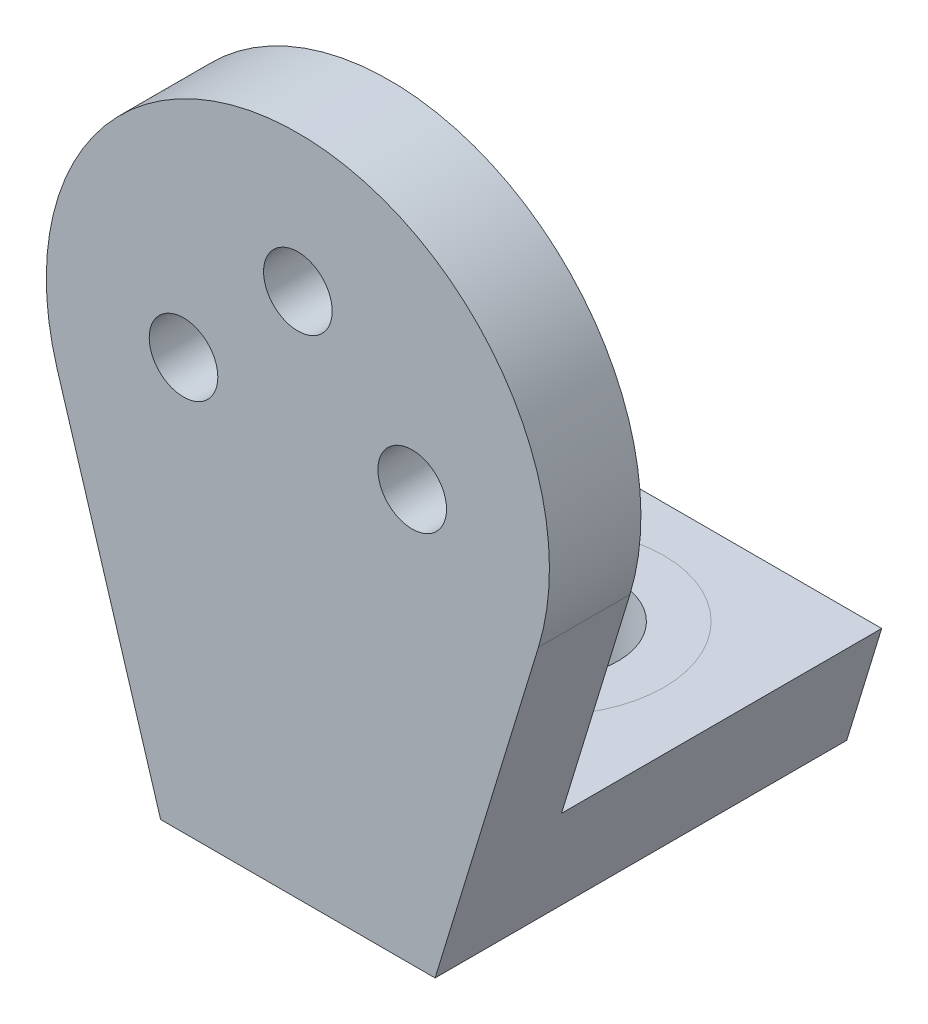
ISO-10303-21;
HEADER;
FILE_DESCRIPTION(('STEP AP214'),'2;1');
FILE_NAME('part.step','',(''),(''),'','','');
FILE_SCHEMA(('AUTOMOTIVE_DESIGN { 1 0 10303 214 1 1 1 1 }'));
ENDSEC;
DATA;
#1=APPLICATION_CONTEXT('core data for automotive mechanical design processes');
#2=APPLICATION_PROTOCOL_DEFINITION('international standard','automotive_design',2000,#1);
#3=PRODUCT_CONTEXT('',#1,'mechanical');
#4=PRODUCT('Part','Part','',(#3));
#5=PRODUCT_RELATED_PRODUCT_CATEGORY('part','',(#4));
#6=PRODUCT_DEFINITION_FORMATION('','',#4);
#7=PRODUCT_DEFINITION_CONTEXT('part definition',#1,'design');
#8=PRODUCT_DEFINITION('design','',#6,#7);
#9=PRODUCT_DEFINITION_SHAPE('','',#8);
#10=(LENGTH_UNIT() NAMED_UNIT(*) SI_UNIT(.MILLI.,.METRE.));
#11=(NAMED_UNIT(*) PLANE_ANGLE_UNIT() SI_UNIT($,.RADIAN.));
#12=(NAMED_UNIT(*) SI_UNIT($,.STERADIAN.) SOLID_ANGLE_UNIT());
#13=UNCERTAINTY_MEASURE_WITH_UNIT(LENGTH_MEASURE(1.E-05),#10,'distance_accuracy_value','');
#14=(GEOMETRIC_REPRESENTATION_CONTEXT(3) GLOBAL_UNCERTAINTY_ASSIGNED_CONTEXT((#13)) GLOBAL_UNIT_ASSIGNED_CONTEXT((#10,
#11,#12)) REPRESENTATION_CONTEXT('',''));
#15=CARTESIAN_POINT('',(0.,0.,0.));
#16=DIRECTION('',(0.,0.,1.));
#17=DIRECTION('',(1.,0.,0.));
#18=AXIS2_PLACEMENT_3D('',#15,#16,#17);
#19=CARTESIAN_POINT('',(0.,-65.,-70.));
#20=DIRECTION('',(0.,1.,0.));
#21=DIRECTION('',(0.,0.,1.));
#22=AXIS2_PLACEMENT_3D('',#19,#20,#21);
#23=PLANE('',#22);
#24=DIRECTION('',(-1.,0.,0.));
#25=VECTOR('',#24,1.);
#26=CARTESIAN_POINT('',(0.,-65.,0.));
#27=LINE('',#26,#25);
#28=CARTESIAN_POINT('',(37.6423489127024,-65.,0.));
#29=VERTEX_POINT('',#28);
#30=CARTESIAN_POINT('',(-37.6423489127024,-65.,0.));
#31=VERTEX_POINT('',#30);
#32=EDGE_CURVE('E111',#29,#31,#27,.T.);
#33=ORIENTED_EDGE('',*,*,#32,.F.);
#34=DIRECTION('',(0.,0.,1.));
#35=VECTOR('',#34,1.);
#36=CARTESIAN_POINT('',(37.6423489127024,-65.,-70.));
#37=LINE('',#36,#35);
#38=CARTESIAN_POINT('',(37.6423489127024,-65.,-70.));
#39=VERTEX_POINT('',#38);
#40=EDGE_CURVE('E106',#39,#29,#37,.T.);
#41=ORIENTED_EDGE('',*,*,#40,.F.);
#42=DIRECTION('',(-1.,0.,0.));
#43=VECTOR('',#42,1.);
#44=CARTESIAN_POINT('',(0.,-65.,-70.));
#45=LINE('',#44,#43);
#46=CARTESIAN_POINT('',(-37.6423489127024,-65.,-70.));
#47=VERTEX_POINT('',#46);
#48=EDGE_CURVE('E110',#39,#47,#45,.T.);
#49=ORIENTED_EDGE('',*,*,#48,.T.);
#50=DIRECTION('',(0.,0.,1.));
#51=VECTOR('',#50,1.);
#52=CARTESIAN_POINT('',(-37.6423489127024,-65.,-70.));
#53=LINE('',#52,#51);
#54=EDGE_CURVE('E69',#47,#31,#53,.T.);
#55=ORIENTED_EDGE('',*,*,#54,.T.);
#56=EDGE_LOOP('',(#33,#41,#49,#55));
#57=FACE_BOUND('',#56,.T.);
#58=CARTESIAN_POINT('',(0.,-65.,-35.));
#59=DIRECTION('',(0.,1.,0.));
#60=DIRECTION('',(0.,0.,1.));
#61=AXIS2_PLACEMENT_3D('',#58,#59,#60);
#62=CIRCLE('',#61,25.);
#63=CARTESIAN_POINT('',(0.,-65.,-10.));
#64=VERTEX_POINT('',#63);
#65=EDGE_CURVE('E11',#64,#64,#62,.F.);
#66=ORIENTED_EDGE('',*,*,#65,.T.);
#67=EDGE_LOOP('',(#66));
#68=FACE_BOUND('',#67,.T.);
#69=ADVANCED_FACE('F53',(#57,#68),#23,.T.);
#70=CARTESIAN_POINT('',(0.,0.,20.));
#71=DIRECTION('',(0.,0.,-1.));
#72=DIRECTION('',(-1.,0.,0.));
#73=AXIS2_PLACEMENT_3D('',#70,#71,#72);
#74=CYLINDRICAL_SURFACE('',#73,55.);
#75=CARTESIAN_POINT('',(0.,0.,20.));
#76=DIRECTION('',(0.,0.,1.));
#77=DIRECTION('',(1.,0.,0.));
#78=AXIS2_PLACEMENT_3D('',#75,#76,#77);
#79=CIRCLE('',#78,55.);
#80=CARTESIAN_POINT('',(52.5973016261192,-16.078677235738,20.));
#81=VERTEX_POINT('',#80);
#82=CARTESIAN_POINT('',(-52.5973016261192,-16.0786772357381,20.));
#83=VERTEX_POINT('',#82);
#84=EDGE_CURVE('E62',#81,#83,#79,.T.);
#85=ORIENTED_EDGE('',*,*,#84,.F.);
#86=DIRECTION('',(0.,0.,1.));
#87=VECTOR('',#86,1.);
#88=CARTESIAN_POINT('',(52.5973016261192,-16.078677235738,-128.570084049961));
#89=LINE('',#88,#87);
#90=CARTESIAN_POINT('',(52.5973016261192,-16.078677235738,0.));
#91=VERTEX_POINT('',#90);
#92=EDGE_CURVE('E174',#91,#81,#89,.T.);
#93=ORIENTED_EDGE('',*,*,#92,.F.);
#94=CARTESIAN_POINT('',(0.,0.,0.));
#95=DIRECTION('',(0.,0.,1.));
#96=DIRECTION('',(1.,0.,0.));
#97=AXIS2_PLACEMENT_3D('',#94,#95,#96);
#98=CIRCLE('',#97,55.);
#99=CARTESIAN_POINT('',(-52.5973016261192,-16.0786772357381,0.));
#100=VERTEX_POINT('',#99);
#101=EDGE_CURVE('E197',#91,#100,#98,.T.);
#102=ORIENTED_EDGE('',*,*,#101,.T.);
#103=DIRECTION('',(0.,0.,1.));
#104=VECTOR('',#103,1.);
#105=CARTESIAN_POINT('',(-52.5973016261192,-16.0786772357381,-128.570084049961));
#106=LINE('',#105,#104);
#107=EDGE_CURVE('E185',#100,#83,#106,.T.);
#108=ORIENTED_EDGE('',*,*,#107,.T.);
#109=EDGE_LOOP('',(#85,#93,#102,#108));
#110=FACE_BOUND('',#109,.T.);
#111=ADVANCED_FACE('F55',(#110),#74,.T.);
#112=CARTESIAN_POINT('',(0.,0.,20.));
#113=DIRECTION('',(0.,0.,1.));
#114=DIRECTION('',(1.,0.,0.));
#115=AXIS2_PLACEMENT_3D('',#112,#113,#114);
#116=PLANE('',#115);
#117=CARTESIAN_POINT('',(25.,0.,20.));
#118=DIRECTION('',(0.,0.,1.));
#119=DIRECTION('',(1.,0.,0.));
#120=AXIS2_PLACEMENT_3D('',#117,#118,#119);
#121=CIRCLE('',#120,7.5);
#122=CARTESIAN_POINT('',(32.5,0.,20.));
#123=VERTEX_POINT('',#122);
#124=EDGE_CURVE('E151',#123,#123,#121,.F.);
#125=ORIENTED_EDGE('',*,*,#124,.T.);
#126=EDGE_LOOP('',(#125));
#127=FACE_BOUND('',#126,.T.);
#128=CARTESIAN_POINT('',(-25.,0.,20.));
#129=DIRECTION('',(0.,0.,1.));
#130=DIRECTION('',(1.,0.,0.));
#131=AXIS2_PLACEMENT_3D('',#128,#129,#130);
#132=CIRCLE('',#131,7.5);
#133=CARTESIAN_POINT('',(-17.5,0.,20.));
#134=VERTEX_POINT('',#133);
#135=EDGE_CURVE('E115',#134,#134,#132,.F.);
#136=ORIENTED_EDGE('',*,*,#135,.T.);
#137=EDGE_LOOP('',(#136));
#138=FACE_BOUND('',#137,.T.);
#139=CARTESIAN_POINT('',(0.,25.,20.));
#140=DIRECTION('',(0.,0.,1.));
#141=DIRECTION('',(1.,0.,0.));
#142=AXIS2_PLACEMENT_3D('',#139,#140,#141);
#143=CIRCLE('',#142,7.5);
#144=CARTESIAN_POINT('',(7.5,25.,20.));
#145=VERTEX_POINT('',#144);
#146=EDGE_CURVE('E150',#145,#145,#143,.F.);
#147=ORIENTED_EDGE('',*,*,#146,.T.);
#148=EDGE_LOOP('',(#147));
#149=FACE_BOUND('',#148,.T.);
#150=ORIENTED_EDGE('',*,*,#84,.T.);
#151=DIRECTION('',(0.292339586104328,-0.956314575020349,0.));
#152=VECTOR('',#151,1.);
#153=CARTESIAN_POINT('',(-52.5973016261192,-16.0786772357381,20.));
#154=LINE('',#153,#152);
#155=CARTESIAN_POINT('',(-30.,-90.,20.));
#156=VERTEX_POINT('',#155);
#157=EDGE_CURVE('E166',#83,#156,#154,.T.);
#158=ORIENTED_EDGE('',*,*,#157,.T.);
#159=DIRECTION('',(1.,0.,0.));
#160=VECTOR('',#159,1.);
#161=CARTESIAN_POINT('',(0.,-90.,20.));
#162=LINE('',#161,#160);
#163=CARTESIAN_POINT('',(30.,-90.,20.));
#164=VERTEX_POINT('',#163);
#165=EDGE_CURVE('E178',#156,#164,#162,.T.);
#166=ORIENTED_EDGE('',*,*,#165,.T.);
#167=DIRECTION('',(-0.292339586104328,-0.956314575020349,0.));
#168=VECTOR('',#167,1.);
#169=CARTESIAN_POINT('',(52.5973016261192,-16.078677235738,20.));
#170=LINE('',#169,#168);
#171=EDGE_CURVE('E182',#81,#164,#170,.T.);
#172=ORIENTED_EDGE('',*,*,#171,.F.);
#173=EDGE_LOOP('',(#150,#158,#166,#172));
#174=FACE_BOUND('',#173,.T.);
#175=ADVANCED_FACE('F210',(#127,#138,#149,#174),#116,.T.);
#176=CARTESIAN_POINT('',(0.,0.,0.));
#177=DIRECTION('',(0.,0.,1.));
#178=DIRECTION('',(1.,0.,0.));
#179=AXIS2_PLACEMENT_3D('',#176,#177,#178);
#180=PLANE('',#179);
#181=CARTESIAN_POINT('',(25.,0.,0.));
#182=DIRECTION('',(0.,0.,-1.));
#183=DIRECTION('',(-1.,0.,0.));
#184=AXIS2_PLACEMENT_3D('',#181,#182,#183);
#185=CIRCLE('',#184,7.5);
#186=CARTESIAN_POINT('',(17.5,0.,0.));
#187=VERTEX_POINT('',#186);
#188=EDGE_CURVE('E146',#187,#187,#185,.T.);
#189=ORIENTED_EDGE('',*,*,#188,.F.);
#190=EDGE_LOOP('',(#189));
#191=FACE_BOUND('',#190,.T.);
#192=CARTESIAN_POINT('',(-25.,0.,0.));
#193=DIRECTION('',(0.,0.,-1.));
#194=DIRECTION('',(-1.,0.,0.));
#195=AXIS2_PLACEMENT_3D('',#192,#193,#194);
#196=CIRCLE('',#195,7.5);
#197=CARTESIAN_POINT('',(-32.5,0.,0.));
#198=VERTEX_POINT('',#197);
#199=EDGE_CURVE('E155',#198,#198,#196,.T.);
#200=ORIENTED_EDGE('',*,*,#199,.F.);
#201=EDGE_LOOP('',(#200));
#202=FACE_BOUND('',#201,.T.);
#203=CARTESIAN_POINT('',(0.,25.,0.));
#204=DIRECTION('',(0.,0.,-1.));
#205=DIRECTION('',(-1.,0.,0.));
#206=AXIS2_PLACEMENT_3D('',#203,#204,#205);
#207=CIRCLE('',#206,7.5);
#208=CARTESIAN_POINT('',(-7.5,25.,0.));
#209=VERTEX_POINT('',#208);
#210=EDGE_CURVE('E162',#209,#209,#207,.T.);
#211=ORIENTED_EDGE('',*,*,#210,.F.);
#212=EDGE_LOOP('',(#211));
#213=FACE_BOUND('',#212,.T.);
#214=DIRECTION('',(0.292339586104328,0.956314575020349,0.));
#215=VECTOR('',#214,1.);
#216=CARTESIAN_POINT('',(52.5973016261192,-16.078677235738,0.));
#217=LINE('',#216,#215);
#218=EDGE_CURVE('E170',#29,#91,#217,.T.);
#219=ORIENTED_EDGE('',*,*,#218,.F.);
#220=ORIENTED_EDGE('',*,*,#32,.T.);
#221=DIRECTION('',(-0.292339586104328,0.956314575020349,0.));
#222=VECTOR('',#221,1.);
#223=CARTESIAN_POINT('',(-52.5973016261192,-16.0786772357381,0.));
#224=LINE('',#223,#222);
#225=EDGE_CURVE('E173',#31,#100,#224,.T.);
#226=ORIENTED_EDGE('',*,*,#225,.T.);
#227=ORIENTED_EDGE('',*,*,#101,.F.);
#228=EDGE_LOOP('',(#219,#220,#226,#227));
#229=FACE_BOUND('',#228,.T.);
#230=ADVANCED_FACE('F212',(#191,#202,#213,#229),#180,.F.);
#231=CARTESIAN_POINT('',(52.5973016261192,-16.078677235738,-128.570084049961));
#232=DIRECTION('',(-0.956314575020349,0.292339586104328,0.));
#233=DIRECTION('',(-0.292339586104328,-0.956314575020349,0.));
#234=AXIS2_PLACEMENT_3D('',#231,#232,#233);
#235=PLANE('',#234);
#236=DIRECTION('',(0.,0.,1.));
#237=VECTOR('',#236,1.);
#238=CARTESIAN_POINT('',(30.,-90.,-128.570084049961));
#239=LINE('',#238,#237);
#240=CARTESIAN_POINT('',(30.,-90.,-70.));
#241=VERTEX_POINT('',#240);
#242=EDGE_CURVE('E121',#241,#164,#239,.T.);
#243=ORIENTED_EDGE('',*,*,#242,.F.);
#244=DIRECTION('',(-0.292339586104328,-0.956314575020349,0.));
#245=VECTOR('',#244,1.);
#246=CARTESIAN_POINT('',(52.5973016261192,-16.078677235738,-70.));
#247=LINE('',#246,#245);
#248=EDGE_CURVE('E118',#39,#241,#247,.T.);
#249=ORIENTED_EDGE('',*,*,#248,.F.);
#250=ORIENTED_EDGE('',*,*,#40,.T.);
#251=ORIENTED_EDGE('',*,*,#218,.T.);
#252=ORIENTED_EDGE('',*,*,#92,.T.);
#253=ORIENTED_EDGE('',*,*,#171,.T.);
#254=EDGE_LOOP('',(#243,#249,#250,#251,#252,#253));
#255=FACE_BOUND('',#254,.T.);
#256=ADVANCED_FACE('F119',(#255),#235,.F.);
#257=CARTESIAN_POINT('',(0.,-90.,-128.570084049961));
#258=DIRECTION('',(0.,-1.,0.));
#259=DIRECTION('',(1.,0.,0.));
#260=AXIS2_PLACEMENT_3D('',#257,#258,#259);
#261=PLANE('',#260);
#262=CARTESIAN_POINT('',(0.,-90.,-35.));
#263=DIRECTION('',(0.,-1.,0.));
#264=DIRECTION('',(1.,0.,0.));
#265=AXIS2_PLACEMENT_3D('',#262,#263,#264);
#266=CIRCLE('',#265,15.);
#267=CARTESIAN_POINT('',(15.,-90.,-35.));
#268=VERTEX_POINT('',#267);
#269=EDGE_CURVE('E137',#268,#268,#266,.F.);
#270=ORIENTED_EDGE('',*,*,#269,.T.);
#271=EDGE_LOOP('',(#270));
#272=FACE_BOUND('',#271,.T.);
#273=DIRECTION('',(0.,0.,1.));
#274=VECTOR('',#273,1.);
#275=CARTESIAN_POINT('',(-30.,-90.,-128.570084049961));
#276=LINE('',#275,#274);
#277=CARTESIAN_POINT('',(-30.,-90.,-70.));
#278=VERTEX_POINT('',#277);
#279=EDGE_CURVE('E190',#278,#156,#276,.T.);
#280=ORIENTED_EDGE('',*,*,#279,.F.);
#281=DIRECTION('',(-1.,0.,0.));
#282=VECTOR('',#281,1.);
#283=CARTESIAN_POINT('',(0.,-90.,-70.));
#284=LINE('',#283,#282);
#285=EDGE_CURVE('E126',#241,#278,#284,.T.);
#286=ORIENTED_EDGE('',*,*,#285,.F.);
#287=ORIENTED_EDGE('',*,*,#242,.T.);
#288=ORIENTED_EDGE('',*,*,#165,.F.);
#289=EDGE_LOOP('',(#280,#286,#287,#288));
#290=FACE_BOUND('',#289,.T.);
#291=ADVANCED_FACE('F219',(#272,#290),#261,.T.);
#292=CARTESIAN_POINT('',(-52.5973016261192,-16.0786772357381,-128.570084049961));
#293=DIRECTION('',(-0.956314575020349,-0.292339586104328,0.));
#294=DIRECTION('',(0.292339586104328,-0.956314575020349,0.));
#295=AXIS2_PLACEMENT_3D('',#292,#293,#294);
#296=PLANE('',#295);
#297=ORIENTED_EDGE('',*,*,#225,.F.);
#298=ORIENTED_EDGE('',*,*,#54,.F.);
#299=DIRECTION('',(-0.292339586104328,0.956314575020349,0.));
#300=VECTOR('',#299,1.);
#301=CARTESIAN_POINT('',(-52.5973016261192,-16.0786772357381,-70.));
#302=LINE('',#301,#300);
#303=EDGE_CURVE('E130',#278,#47,#302,.T.);
#304=ORIENTED_EDGE('',*,*,#303,.F.);
#305=ORIENTED_EDGE('',*,*,#279,.T.);
#306=ORIENTED_EDGE('',*,*,#157,.F.);
#307=ORIENTED_EDGE('',*,*,#107,.F.);
#308=EDGE_LOOP('',(#297,#298,#304,#305,#306,#307));
#309=FACE_BOUND('',#308,.T.);
#310=ADVANCED_FACE('F207',(#309),#296,.T.);
#311=CARTESIAN_POINT('',(0.,25.,20.001));
#312=DIRECTION('',(0.,0.,-1.));
#313=DIRECTION('',(-1.,0.,0.));
#314=AXIS2_PLACEMENT_3D('',#311,#312,#313);
#315=CYLINDRICAL_SURFACE('',#314,7.5);
#316=ORIENTED_EDGE('',*,*,#146,.F.);
#317=EDGE_LOOP('',(#316));
#318=FACE_BOUND('',#317,.T.);
#319=ORIENTED_EDGE('',*,*,#210,.T.);
#320=EDGE_LOOP('',(#319));
#321=FACE_BOUND('',#320,.T.);
#322=ADVANCED_FACE('F278',(#318,#321),#315,.F.);
#323=CARTESIAN_POINT('',(-25.,0.,20.001));
#324=DIRECTION('',(0.,0.,-1.));
#325=DIRECTION('',(-1.,0.,0.));
#326=AXIS2_PLACEMENT_3D('',#323,#324,#325);
#327=CYLINDRICAL_SURFACE('',#326,7.5);
#328=ORIENTED_EDGE('',*,*,#135,.F.);
#329=EDGE_LOOP('',(#328));
#330=FACE_BOUND('',#329,.T.);
#331=ORIENTED_EDGE('',*,*,#199,.T.);
#332=EDGE_LOOP('',(#331));
#333=FACE_BOUND('',#332,.T.);
#334=ADVANCED_FACE('F242',(#330,#333),#327,.F.);
#335=CARTESIAN_POINT('',(25.,0.,20.001));
#336=DIRECTION('',(0.,0.,-1.));
#337=DIRECTION('',(-1.,0.,0.));
#338=AXIS2_PLACEMENT_3D('',#335,#336,#337);
#339=CYLINDRICAL_SURFACE('',#338,7.5);
#340=ORIENTED_EDGE('',*,*,#124,.F.);
#341=EDGE_LOOP('',(#340));
#342=FACE_BOUND('',#341,.T.);
#343=ORIENTED_EDGE('',*,*,#188,.T.);
#344=EDGE_LOOP('',(#343));
#345=FACE_BOUND('',#344,.T.);
#346=ADVANCED_FACE('F236',(#342,#345),#339,.F.);
#347=ORIENTED_EDGE('',*,*,#65,.F.);
#348=EDGE_LOOP('',(#347));
#349=FACE_BOUND('',#348,.T.);
#350=CARTESIAN_POINT('',(0.,-65.,-35.));
#351=DIRECTION('',(0.,1.,0.));
#352=DIRECTION('',(0.,0.,1.));
#353=AXIS2_PLACEMENT_3D('',#350,#351,#352);
#354=CIRCLE('',#353,15.);
#355=CARTESIAN_POINT('',(0.,-65.,-20.));
#356=VERTEX_POINT('',#355);
#357=EDGE_CURVE('E134',#356,#356,#354,.T.);
#358=ORIENTED_EDGE('',*,*,#357,.F.);
#359=EDGE_LOOP('',(#358));
#360=FACE_BOUND('',#359,.T.);
#361=ADVANCED_FACE('F228',(#349,#360),#23,.T.);
#362=CARTESIAN_POINT('',(0.,0.,-70.));
#363=DIRECTION('',(0.,0.,-1.));
#364=DIRECTION('',(-1.,0.,0.));
#365=AXIS2_PLACEMENT_3D('',#362,#363,#364);
#366=PLANE('',#365);
#367=ORIENTED_EDGE('',*,*,#48,.F.);
#368=ORIENTED_EDGE('',*,*,#248,.T.);
#369=ORIENTED_EDGE('',*,*,#285,.T.);
#370=ORIENTED_EDGE('',*,*,#303,.T.);
#371=EDGE_LOOP('',(#367,#368,#369,#370));
#372=FACE_BOUND('',#371,.T.);
#373=ADVANCED_FACE('F128',(#372),#366,.T.);
#374=CARTESIAN_POINT('',(0.,-90.001,-35.));
#375=DIRECTION('',(0.,1.,0.));
#376=DIRECTION('',(0.,0.,1.));
#377=AXIS2_PLACEMENT_3D('',#374,#375,#376);
#378=CYLINDRICAL_SURFACE('',#377,15.);
#379=ORIENTED_EDGE('',*,*,#269,.F.);
#380=EDGE_LOOP('',(#379));
#381=FACE_BOUND('',#380,.T.);
#382=ORIENTED_EDGE('',*,*,#357,.T.);
#383=EDGE_LOOP('',(#382));
#384=FACE_BOUND('',#383,.T.);
#385=ADVANCED_FACE('F241',(#381,#384),#378,.F.);
#386=CLOSED_SHELL('',(#69,#111,#175,#230,#256,#291,#310,#322,#334,#346,#361,#373,#385));
#387=MANIFOLD_SOLID_BREP('B2',#386);
#388=ADVANCED_BREP_SHAPE_REPRESENTATION('',(#18,#387),#14);
#389=SHAPE_DEFINITION_REPRESENTATION(#9,#388);
ENDSEC;
END-ISO-10303-21;
